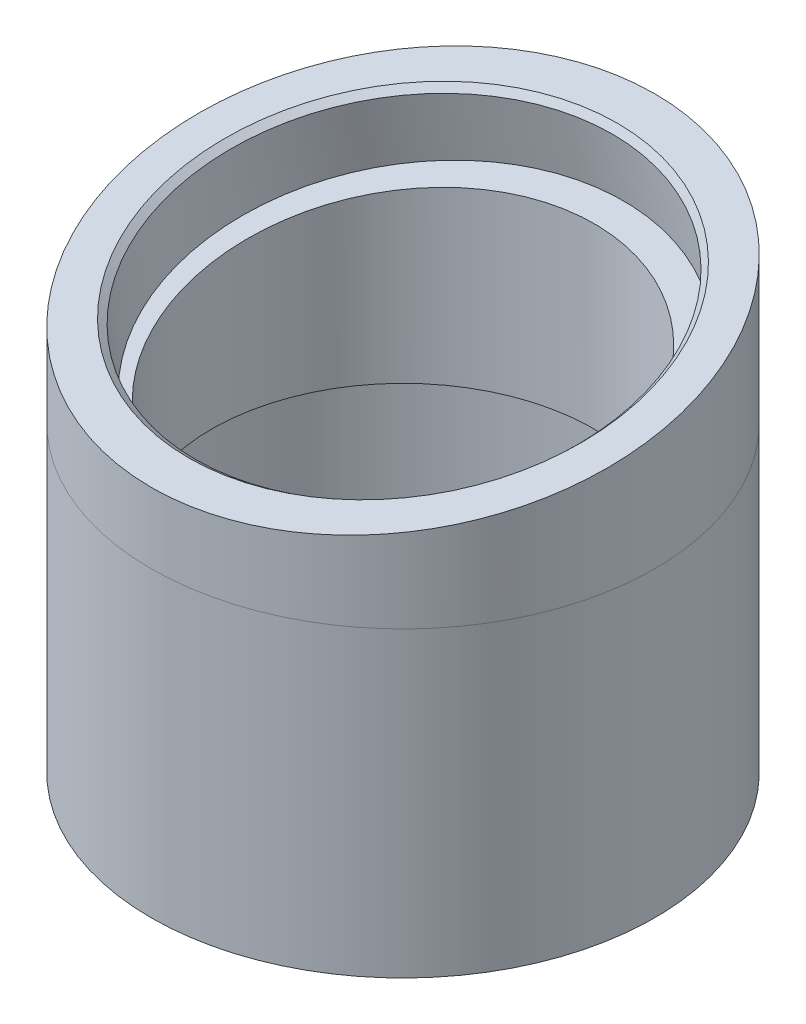
ISO-10303-21;
HEADER;
FILE_DESCRIPTION(('STEP AP214'),'2;1');
FILE_NAME('part.step','',(''),(''),'','','');
FILE_SCHEMA(('AUTOMOTIVE_DESIGN { 1 0 10303 214 1 1 1 1 }'));
ENDSEC;
DATA;
#1=APPLICATION_CONTEXT('core data for automotive mechanical design processes');
#2=APPLICATION_PROTOCOL_DEFINITION('international standard','automotive_design',2000,#1);
#3=PRODUCT_CONTEXT('',#1,'mechanical');
#4=PRODUCT('Part','Part','',(#3));
#5=PRODUCT_RELATED_PRODUCT_CATEGORY('part','',(#4));
#6=PRODUCT_DEFINITION_FORMATION('','',#4);
#7=PRODUCT_DEFINITION_CONTEXT('part definition',#1,'design');
#8=PRODUCT_DEFINITION('design','',#6,#7);
#9=PRODUCT_DEFINITION_SHAPE('','',#8);
#10=(LENGTH_UNIT() NAMED_UNIT(*) SI_UNIT(.MILLI.,.METRE.));
#11=(NAMED_UNIT(*) PLANE_ANGLE_UNIT() SI_UNIT($,.RADIAN.));
#12=(NAMED_UNIT(*) SI_UNIT($,.STERADIAN.) SOLID_ANGLE_UNIT());
#13=UNCERTAINTY_MEASURE_WITH_UNIT(LENGTH_MEASURE(1.E-05),#10,'distance_accuracy_value','');
#14=(GEOMETRIC_REPRESENTATION_CONTEXT(3) GLOBAL_UNCERTAINTY_ASSIGNED_CONTEXT((#13)) GLOBAL_UNIT_ASSIGNED_CONTEXT((#10,
#11,#12)) REPRESENTATION_CONTEXT('',''));
#15=CARTESIAN_POINT('',(0.,0.,0.));
#16=DIRECTION('',(0.,0.,1.));
#17=DIRECTION('',(1.,0.,0.));
#18=AXIS2_PLACEMENT_3D('',#15,#16,#17);
#19=CARTESIAN_POINT('',(2.6936026936027,8.51851851851887,50.));
#20=DIRECTION('',(0.,1.,0.));
#21=DIRECTION('',(0.,0.,1.));
#22=AXIS2_PLACEMENT_3D('',#19,#20,#21);
#23=PLANE('',#22);
#24=CARTESIAN_POINT('',(2.6936026936027,8.51851851851887,50.));
#25=DIRECTION('',(0.,1.,0.));
#26=DIRECTION('',(0.,0.,1.));
#27=AXIS2_PLACEMENT_3D('',#24,#25,#26);
#28=CIRCLE('',#27,25.);
#29=CARTESIAN_POINT('',(2.6936026936027,8.51851851851887,75.));
#30=VERTEX_POINT('',#29);
#31=EDGE_CURVE('P0_E10',#30,#30,#28,.T.);
#32=ORIENTED_EDGE('',*,*,#31,.T.);
#33=EDGE_LOOP('',(#32));
#34=FACE_BOUND('',#33,.T.);
#35=CARTESIAN_POINT('',(1.9490510783081,8.51851851851887,50.));
#36=DIRECTION('',(0.,1.,0.));
#37=DIRECTION('',(0.,0.,1.));
#38=AXIS2_PLACEMENT_3D('',#35,#36,#37);
#39=CIRCLE('',#38,24.);
#40=CARTESIAN_POINT('',(1.9490510783081,8.51851851851887,74.));
#41=VERTEX_POINT('',#40);
#42=EDGE_CURVE('P0_E26',#41,#41,#39,.T.);
#43=ORIENTED_EDGE('',*,*,#42,.F.);
#44=EDGE_LOOP('',(#43));
#45=FACE_BOUND('',#44,.T.);
#46=ADVANCED_FACE('P0_F15',(#34,#45),#23,.T.);
#47=CARTESIAN_POINT('',(2.6936026936027,-21.4814814814811,50.));
#48=DIRECTION('',(0.,1.,0.));
#49=DIRECTION('',(0.,0.,1.));
#50=AXIS2_PLACEMENT_3D('',#47,#48,#49);
#51=PLANE('',#50);
#52=CARTESIAN_POINT('',(2.6936026936027,-21.4814814814811,50.));
#53=DIRECTION('',(0.,1.,0.));
#54=DIRECTION('',(0.,0.,1.));
#55=AXIS2_PLACEMENT_3D('',#52,#53,#54);
#56=CIRCLE('',#55,25.);
#57=CARTESIAN_POINT('',(2.6936026936027,-21.4814814814811,75.));
#58=VERTEX_POINT('',#57);
#59=EDGE_CURVE('P0_E19',#58,#58,#56,.T.);
#60=ORIENTED_EDGE('',*,*,#59,.F.);
#61=EDGE_LOOP('',(#60));
#62=FACE_BOUND('',#61,.T.);
#63=CARTESIAN_POINT('',(1.9490510783081,-21.4814814814811,50.));
#64=DIRECTION('',(0.,1.,0.));
#65=DIRECTION('',(0.,0.,1.));
#66=AXIS2_PLACEMENT_3D('',#63,#64,#65);
#67=CIRCLE('',#66,24.);
#68=CARTESIAN_POINT('',(1.9490510783081,-21.4814814814811,74.));
#69=VERTEX_POINT('',#68);
#70=EDGE_CURVE('P0_E28',#69,#69,#67,.T.);
#71=ORIENTED_EDGE('',*,*,#70,.T.);
#72=EDGE_LOOP('',(#71));
#73=FACE_BOUND('',#72,.T.);
#74=ADVANCED_FACE('P0_F38',(#62,#73),#51,.F.);
#75=CARTESIAN_POINT('',(2.6936026936027,8.51851851851887,50.));
#76=DIRECTION('',(0.,-1.,0.));
#77=DIRECTION('',(0.,0.,-1.));
#78=AXIS2_PLACEMENT_3D('',#75,#76,#77);
#79=CYLINDRICAL_SURFACE('',#78,25.);
#80=ORIENTED_EDGE('',*,*,#31,.F.);
#81=EDGE_LOOP('',(#80));
#82=FACE_BOUND('',#81,.T.);
#83=ORIENTED_EDGE('',*,*,#59,.T.);
#84=EDGE_LOOP('',(#83));
#85=FACE_BOUND('',#84,.T.);
#86=ADVANCED_FACE('P0_F17',(#82,#85),#79,.T.);
#87=CARTESIAN_POINT('',(1.9490510783081,8.51851851851887,50.));
#88=DIRECTION('',(0.,-1.,0.));
#89=DIRECTION('',(0.,0.,-1.));
#90=AXIS2_PLACEMENT_3D('',#87,#88,#89);
#91=CYLINDRICAL_SURFACE('',#90,24.);
#92=ORIENTED_EDGE('',*,*,#42,.T.);
#93=EDGE_LOOP('',(#92));
#94=FACE_BOUND('',#93,.T.);
#95=ORIENTED_EDGE('',*,*,#70,.F.);
#96=EDGE_LOOP('',(#95));
#97=FACE_BOUND('',#96,.T.);
#98=ADVANCED_FACE('P0_F34',(#94,#97),#91,.F.);
#99=CLOSED_SHELL('',(#46,#74,#86,#98));
#100=MANIFOLD_SOLID_BREP('P0_B1',#99);
#101=CARTESIAN_POINT('',(2.6936026936027,8.51851851851887,50.));
#102=DIRECTION('',(0.,-1.,0.));
#103=DIRECTION('',(0.,0.,-1.));
#104=AXIS2_PLACEMENT_3D('',#101,#102,#103);
#105=CYLINDRICAL_SURFACE('',#104,19.);
#106=CARTESIAN_POINT('',(2.6936026936027,-1.48148148148113,50.));
#107=DIRECTION('',(0.,1.,0.));
#108=DIRECTION('',(0.,0.,1.));
#109=AXIS2_PLACEMENT_3D('',#106,#107,#108);
#110=CIRCLE('',#109,19.);
#111=CARTESIAN_POINT('',(2.6936026936027,-1.48148148148113,69.));
#112=VERTEX_POINT('',#111);
#113=EDGE_CURVE('P1_E41',#112,#112,#110,.T.);
#114=ORIENTED_EDGE('',*,*,#113,.F.);
#115=EDGE_LOOP('',(#114));
#116=FACE_BOUND('',#115,.T.);
#117=CARTESIAN_POINT('',(2.6936026936027,12.8187067530303,50.));
#118=DIRECTION('',(0.,0.984807753012208,0.173648177666931));
#119=DIRECTION('',(0.,-0.173648177666931,0.984807753012208));
#120=AXIS2_PLACEMENT_3D('',#117,#118,#119);
#121=ELLIPSE('',#120,19.2931056258292,19.);
#122=CARTESIAN_POINT('',(2.6936026936027,9.46849411956945,69.));
#123=VERTEX_POINT('',#122);
#124=EDGE_CURVE('P1_E33',#123,#123,#121,.T.);
#125=ORIENTED_EDGE('',*,*,#124,.T.);
#126=EDGE_LOOP('',(#125));
#127=FACE_BOUND('',#126,.T.);
#128=ADVANCED_FACE('P1_F14',(#116,#127),#105,.F.);
#129=CARTESIAN_POINT('',(2.6936026936027,-1.48148148148113,50.));
#130=DIRECTION('',(0.,1.,0.));
#131=DIRECTION('',(0.,0.,1.));
#132=AXIS2_PLACEMENT_3D('',#129,#130,#131);
#133=PLANE('',#132);
#134=CARTESIAN_POINT('',(2.6936026936027,-1.48148148148113,50.));
#135=DIRECTION('',(0.,1.,0.));
#136=DIRECTION('',(0.,0.,1.));
#137=AXIS2_PLACEMENT_3D('',#134,#135,#136);
#138=CIRCLE('',#137,24.);
#139=CARTESIAN_POINT('',(2.6936026936027,-1.48148148148113,74.));
#140=VERTEX_POINT('',#139);
#141=EDGE_CURVE('P1_E38',#140,#140,#138,.T.);
#142=ORIENTED_EDGE('',*,*,#141,.F.);
#143=EDGE_LOOP('',(#142));
#144=FACE_BOUND('',#143,.T.);
#145=ORIENTED_EDGE('',*,*,#113,.T.);
#146=EDGE_LOOP('',(#145));
#147=FACE_BOUND('',#146,.T.);
#148=ADVANCED_FACE('P1_F67',(#144,#147),#133,.F.);
#149=CARTESIAN_POINT('',(2.6936026936027,8.51851851851887,50.));
#150=DIRECTION('',(0.,-1.,0.));
#151=DIRECTION('',(0.,0.,-1.));
#152=AXIS2_PLACEMENT_3D('',#149,#150,#151);
#153=CYLINDRICAL_SURFACE('',#152,24.);
#154=CARTESIAN_POINT('',(2.6936026936027,8.51851851851887,50.));
#155=DIRECTION('',(0.,1.,0.));
#156=DIRECTION('',(0.,0.,1.));
#157=AXIS2_PLACEMENT_3D('',#154,#155,#156);
#158=CIRCLE('',#157,24.);
#159=CARTESIAN_POINT('',(2.6936026936027,8.51851851851887,74.));
#160=VERTEX_POINT('',#159);
#161=EDGE_CURVE('P1_E30',#160,#160,#158,.T.);
#162=ORIENTED_EDGE('',*,*,#161,.F.);
#163=EDGE_LOOP('',(#162));
#164=FACE_BOUND('',#163,.T.);
#165=ORIENTED_EDGE('',*,*,#141,.T.);
#166=EDGE_LOOP('',(#165));
#167=FACE_BOUND('',#166,.T.);
#168=ADVANCED_FACE('P1_F73',(#164,#167),#153,.T.);
#169=CARTESIAN_POINT('',(2.6936026936027,8.51851851851887,50.));
#170=DIRECTION('',(0.,1.,0.));
#171=DIRECTION('',(0.,0.,1.));
#172=AXIS2_PLACEMENT_3D('',#169,#170,#171);
#173=PLANE('',#172);
#174=ORIENTED_EDGE('',*,*,#161,.T.);
#175=EDGE_LOOP('',(#174));
#176=FACE_BOUND('',#175,.T.);
#177=CARTESIAN_POINT('',(2.6936026936027,8.51851851851887,50.));
#178=DIRECTION('',(0.,1.,0.));
#179=DIRECTION('',(0.,0.,1.));
#180=AXIS2_PLACEMENT_3D('',#177,#178,#179);
#181=CIRCLE('',#180,25.);
#182=CARTESIAN_POINT('',(2.6936026936027,8.51851851851887,75.));
#183=VERTEX_POINT('',#182);
#184=EDGE_CURVE('P1_E35',#183,#183,#181,.T.);
#185=ORIENTED_EDGE('',*,*,#184,.F.);
#186=EDGE_LOOP('',(#185));
#187=FACE_BOUND('',#186,.T.);
#188=ADVANCED_FACE('P1_F81',(#176,#187),#173,.F.);
#189=CARTESIAN_POINT('',(2.6936026936027,28.5185185185189,50.));
#190=DIRECTION('',(0.,-1.,0.));
#191=DIRECTION('',(0.,0.,-1.));
#192=AXIS2_PLACEMENT_3D('',#189,#190,#191);
#193=CYLINDRICAL_SURFACE('',#192,25.);
#194=CARTESIAN_POINT('',(2.6936026936027,19.9266930362305,50.));
#195=DIRECTION('',(0.,-0.984807753012208,-0.173648177666931));
#196=DIRECTION('',(0.,-0.173648177666931,0.984807753012208));
#197=AXIS2_PLACEMENT_3D('',#194,#195,#196);
#198=ELLIPSE('',#197,25.3856652971436,25.);
#199=CARTESIAN_POINT('',(2.6936026936027,15.5185185185189,75.));
#200=VERTEX_POINT('',#199);
#201=EDGE_CURVE('P1_E26',#200,#200,#198,.T.);
#202=ORIENTED_EDGE('',*,*,#201,.T.);
#203=EDGE_LOOP('',(#202));
#204=FACE_BOUND('',#203,.T.);
#205=ORIENTED_EDGE('',*,*,#184,.T.);
#206=EDGE_LOOP('',(#205));
#207=FACE_BOUND('',#206,.T.);
#208=ADVANCED_FACE('P1_F64',(#204,#207),#193,.T.);
#209=CARTESIAN_POINT('',(-28.3063973063973,15.5185185185189,75.));
#210=DIRECTION('',(0.,-0.984807753012208,-0.173648177666931));
#211=DIRECTION('',(0.,0.173648177666931,-0.984807753012208));
#212=AXIS2_PLACEMENT_3D('',#209,#210,#211);
#213=PLANE('',#212);
#214=CARTESIAN_POINT('',(2.6936026936027,19.9266930362305,50.));
#215=DIRECTION('',(0.,-0.984807753012208,-0.173648177666931));
#216=DIRECTION('',(0.,0.173648177666931,-0.984807753012208));
#217=AXIS2_PLACEMENT_3D('',#214,#215,#216);
#218=CIRCLE('',#217,21.6);
#219=CARTESIAN_POINT('',(2.6936026936027,23.6774936738362,28.7281525349363));
#220=VERTEX_POINT('',#219);
#221=EDGE_CURVE('P1_E9',#220,#220,#218,.T.);
#222=ORIENTED_EDGE('',*,*,#221,.T.);
#223=EDGE_LOOP('',(#222));
#224=FACE_BOUND('',#223,.T.);
#225=ORIENTED_EDGE('',*,*,#201,.F.);
#226=EDGE_LOOP('',(#225));
#227=FACE_BOUND('',#226,.T.);
#228=ADVANCED_FACE('P1_F55',(#224,#227),#213,.F.);
#229=CARTESIAN_POINT('',(2.6936026936027,13.0330387651451,48.7844627563315));
#230=DIRECTION('',(0.,0.984807753012208,0.173648177666931));
#231=DIRECTION('',(0.,-0.173648177666931,0.984807753012208));
#232=AXIS2_PLACEMENT_3D('',#229,#230,#231);
#233=CYLINDRICAL_SURFACE('',#232,21.);
#234=CARTESIAN_POINT('',(2.6936026936027,19.3358083844232,49.8958110933998));
#235=DIRECTION('',(0.,-0.984807753012208,-0.173648177666931));
#236=DIRECTION('',(0.,0.173648177666931,-0.984807753012208));
#237=AXIS2_PLACEMENT_3D('',#234,#235,#236);
#238=CIRCLE('',#237,21.);
#239=CARTESIAN_POINT('',(2.6936026936027,22.9824201154288,29.2148482801435));
#240=VERTEX_POINT('',#239);
#241=EDGE_CURVE('P1_E22',#240,#240,#238,.F.);
#242=ORIENTED_EDGE('',*,*,#241,.T.);
#243=EDGE_LOOP('',(#242));
#244=FACE_BOUND('',#243,.T.);
#245=CARTESIAN_POINT('',(2.6936026936027,13.0330387651451,48.7844627563315));
#246=DIRECTION('',(0.,0.984807753012208,0.173648177666931));
#247=DIRECTION('',(0.,-0.173648177666931,0.984807753012208));
#248=AXIS2_PLACEMENT_3D('',#245,#246,#247);
#249=CIRCLE('',#248,21.);
#250=CARTESIAN_POINT('',(2.6936026936027,9.38642703413951,69.4654255695879));
#251=VERTEX_POINT('',#250);
#252=EDGE_CURVE('P1_E36',#251,#251,#249,.T.);
#253=ORIENTED_EDGE('',*,*,#252,.F.);
#254=EDGE_LOOP('',(#253));
#255=FACE_BOUND('',#254,.T.);
#256=ADVANCED_FACE('P1_F53',(#244,#255),#233,.F.);
#257=CARTESIAN_POINT('',(2.6936026936027,13.0330387651451,48.7844627563315));
#258=DIRECTION('',(0.,0.984807753012208,0.173648177666931));
#259=DIRECTION('',(0.,-0.173648177666931,0.984807753012208));
#260=AXIS2_PLACEMENT_3D('',#257,#258,#259);
#261=PLANE('',#260);
#262=ORIENTED_EDGE('',*,*,#124,.F.);
#263=EDGE_LOOP('',(#262));
#264=FACE_BOUND('',#263,.T.);
#265=ORIENTED_EDGE('',*,*,#252,.T.);
#266=EDGE_LOOP('',(#265));
#267=FACE_BOUND('',#266,.T.);
#268=ADVANCED_FACE('P1_F51',(#264,#267),#261,.T.);
#269=CARTESIAN_POINT('',(2.6936026936027,19.3358083844232,49.8958110933998));
#270=DIRECTION('',(0.,0.984807753012208,0.173648177666931));
#271=DIRECTION('',(0.,-0.173648177666931,0.984807753012208));
#272=AXIS2_PLACEMENT_3D('',#269,#270,#271);
#273=CONICAL_SURFACE('',#272,21.,0.785398163397441);
#274=ORIENTED_EDGE('',*,*,#221,.F.);
#275=EDGE_LOOP('',(#274));
#276=FACE_BOUND('',#275,.T.);
#277=ORIENTED_EDGE('',*,*,#241,.F.);
#278=EDGE_LOOP('',(#277));
#279=FACE_BOUND('',#278,.T.);
#280=ADVANCED_FACE('P1_F17',(#276,#279),#273,.F.);
#281=CLOSED_SHELL('',(#128,#148,#168,#188,#208,#228,#256,#268,#280));
#282=MANIFOLD_SOLID_BREP('P1_B1',#281);
#283=ADVANCED_BREP_SHAPE_REPRESENTATION('',(#18,#100,#282),#14);
#284=SHAPE_DEFINITION_REPRESENTATION(#9,#283);
ENDSEC;
END-ISO-10303-21;
